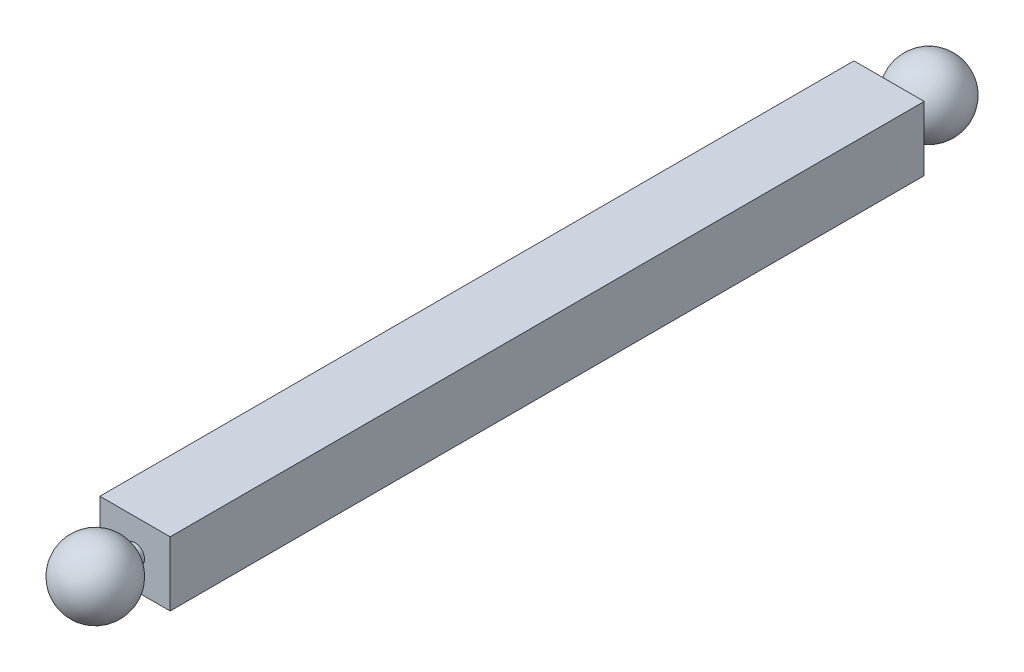
ISO-10303-21;
HEADER;
FILE_DESCRIPTION(('STEP AP214'),'2;1');
FILE_NAME('part.step','',(''),(''),'','','');
FILE_SCHEMA(('AUTOMOTIVE_DESIGN { 1 0 10303 214 1 1 1 1 }'));
ENDSEC;
DATA;
#1=APPLICATION_CONTEXT('core data for automotive mechanical design processes');
#2=APPLICATION_PROTOCOL_DEFINITION('international standard','automotive_design',2000,#1);
#3=PRODUCT_CONTEXT('',#1,'mechanical');
#4=PRODUCT('Part','Part','',(#3));
#5=PRODUCT_RELATED_PRODUCT_CATEGORY('part','',(#4));
#6=PRODUCT_DEFINITION_FORMATION('','',#4);
#7=PRODUCT_DEFINITION_CONTEXT('part definition',#1,'design');
#8=PRODUCT_DEFINITION('design','',#6,#7);
#9=PRODUCT_DEFINITION_SHAPE('','',#8);
#10=(LENGTH_UNIT() NAMED_UNIT(*) SI_UNIT(.MILLI.,.METRE.));
#11=(NAMED_UNIT(*) PLANE_ANGLE_UNIT() SI_UNIT($,.RADIAN.));
#12=(NAMED_UNIT(*) SI_UNIT($,.STERADIAN.) SOLID_ANGLE_UNIT());
#13=UNCERTAINTY_MEASURE_WITH_UNIT(LENGTH_MEASURE(1.E-05),#10,'distance_accuracy_value','');
#14=(GEOMETRIC_REPRESENTATION_CONTEXT(3) GLOBAL_UNCERTAINTY_ASSIGNED_CONTEXT((#13)) GLOBAL_UNIT_ASSIGNED_CONTEXT((#10,
#11,#12)) REPRESENTATION_CONTEXT('',''));
#15=CARTESIAN_POINT('',(0.,0.,0.));
#16=DIRECTION('',(0.,0.,1.));
#17=DIRECTION('',(1.,0.,0.));
#18=AXIS2_PLACEMENT_3D('',#15,#16,#17);
#19=CARTESIAN_POINT('',(-10.5102913715739,-5.52073960024874,5.));
#20=DIRECTION('',(0.737738097229949,0.675087031348947,0.));
#21=DIRECTION('',(0.675087031348947,-0.737738097229949,0.));
#22=AXIS2_PLACEMENT_3D('',#19,#20,#21);
#23=SPHERICAL_SURFACE('',#22,4.4);
#24=CARTESIAN_POINT('',(-10.5102913715739,-5.52073960024874,5.));
#25=DIRECTION('',(0.,0.,1.));
#26=DIRECTION('',(1.,0.,0.));
#27=AXIS2_PLACEMENT_3D('',#24,#25,#26);
#28=SPHERICAL_SURFACE('',#27,4.4);
#29=CARTESIAN_POINT('',(-10.5102913715739,-5.52073960024874,0.766797902296654));
#30=DIRECTION('',(0.,0.,1.));
#31=DIRECTION('',(1.,0.,0.));
#32=AXIS2_PLACEMENT_3D('',#29,#30,#31);
#33=CIRCLE('',#32,1.2);
#34=CARTESIAN_POINT('',(-9.31029137157393,-5.52073960024874,0.766797902296654));
#35=VERTEX_POINT('',#34);
#36=EDGE_CURVE('E11',#35,#35,#33,.F.);
#37=ORIENTED_EDGE('',*,*,#36,.F.);
#38=EDGE_LOOP('',(#37));
#39=FACE_BOUND('',#38,.T.);
#40=ADVANCED_FACE('F43',(#39),#28,.T.);
#41=CARTESIAN_POINT('',(-10.5102913715739,-5.52073960024874,5.));
#42=DIRECTION('',(0.,0.,-1.));
#43=DIRECTION('',(-1.,0.,0.));
#44=AXIS2_PLACEMENT_3D('',#41,#42,#43);
#45=CYLINDRICAL_SURFACE('',#44,1.2);
#46=ORIENTED_EDGE('',*,*,#36,.T.);
#47=EDGE_LOOP('',(#46));
#48=FACE_BOUND('',#47,.T.);
#49=CARTESIAN_POINT('',(-10.5102913715739,-5.52073960024874,0.));
#50=DIRECTION('',(0.,0.,1.));
#51=DIRECTION('',(1.,0.,0.));
#52=AXIS2_PLACEMENT_3D('',#49,#50,#51);
#53=CIRCLE('',#52,1.2);
#54=CARTESIAN_POINT('',(-9.31029137157393,-5.52073960024874,0.));
#55=VERTEX_POINT('',#54);
#56=EDGE_CURVE('E54',#55,#55,#53,.T.);
#57=ORIENTED_EDGE('',*,*,#56,.T.);
#58=EDGE_LOOP('',(#57));
#59=FACE_BOUND('',#58,.T.);
#60=ADVANCED_FACE('F45',(#48,#59),#45,.T.);
#61=CARTESIAN_POINT('',(-14.9361696103277,-1.47072101976475,-95.));
#62=DIRECTION('',(1.,0.,0.));
#63=DIRECTION('',(0.,0.,-1.));
#64=AXIS2_PLACEMENT_3D('',#61,#62,#63);
#65=PLANE('',#64);
#66=DIRECTION('',(0.,1.,0.));
#67=VECTOR('',#66,1.);
#68=CARTESIAN_POINT('',(-14.9361696103277,-1.47072101976475,0.));
#69=LINE('',#68,#67);
#70=CARTESIAN_POINT('',(-14.9361696103277,-9.57075818073273,0.));
#71=VERTEX_POINT('',#70);
#72=CARTESIAN_POINT('',(-14.9361696103277,-1.47072101976475,0.));
#73=VERTEX_POINT('',#72);
#74=EDGE_CURVE('E117',#71,#73,#69,.T.);
#75=ORIENTED_EDGE('',*,*,#74,.T.);
#76=DIRECTION('',(0.,0.,1.));
#77=VECTOR('',#76,1.);
#78=CARTESIAN_POINT('',(-14.9361696103277,-1.47072101976475,-95.));
#79=LINE('',#78,#77);
#80=CARTESIAN_POINT('',(-14.9361696103277,-1.47072101976475,-95.));
#81=VERTEX_POINT('',#80);
#82=EDGE_CURVE('E106',#81,#73,#79,.T.);
#83=ORIENTED_EDGE('',*,*,#82,.F.);
#84=DIRECTION('',(0.,1.,0.));
#85=VECTOR('',#84,1.);
#86=CARTESIAN_POINT('',(-14.9361696103277,-1.47072101976475,-95.));
#87=LINE('',#86,#85);
#88=CARTESIAN_POINT('',(-14.9361696103277,-9.57075818073273,-95.));
#89=VERTEX_POINT('',#88);
#90=EDGE_CURVE('E98',#89,#81,#87,.T.);
#91=ORIENTED_EDGE('',*,*,#90,.F.);
#92=DIRECTION('',(0.,0.,1.));
#93=VECTOR('',#92,1.);
#94=CARTESIAN_POINT('',(-14.9361696103277,-9.57075818073273,-95.));
#95=LINE('',#94,#93);
#96=EDGE_CURVE('E113',#89,#71,#95,.T.);
#97=ORIENTED_EDGE('',*,*,#96,.T.);
#98=EDGE_LOOP('',(#75,#83,#91,#97));
#99=FACE_BOUND('',#98,.T.);
#100=ADVANCED_FACE('F146',(#99),#65,.F.);
#101=CARTESIAN_POINT('',(-6.08441313282015,-1.47072101976475,-95.));
#102=DIRECTION('',(0.,-1.,0.));
#103=DIRECTION('',(0.,0.,-1.));
#104=AXIS2_PLACEMENT_3D('',#101,#102,#103);
#105=PLANE('',#104);
#106=DIRECTION('',(1.,0.,0.));
#107=VECTOR('',#106,1.);
#108=CARTESIAN_POINT('',(-6.08441313282015,-1.47072101976475,0.));
#109=LINE('',#108,#107);
#110=CARTESIAN_POINT('',(-6.08441313282015,-1.47072101976475,0.));
#111=VERTEX_POINT('',#110);
#112=EDGE_CURVE('E104',#73,#111,#109,.T.);
#113=ORIENTED_EDGE('',*,*,#112,.T.);
#114=DIRECTION('',(0.,0.,1.));
#115=VECTOR('',#114,1.);
#116=CARTESIAN_POINT('',(-6.08441313282015,-1.47072101976475,-95.));
#117=LINE('',#116,#115);
#118=CARTESIAN_POINT('',(-6.08441313282015,-1.47072101976475,-95.));
#119=VERTEX_POINT('',#118);
#120=EDGE_CURVE('E102',#119,#111,#117,.T.);
#121=ORIENTED_EDGE('',*,*,#120,.F.);
#122=DIRECTION('',(1.,0.,0.));
#123=VECTOR('',#122,1.);
#124=CARTESIAN_POINT('',(-6.08441313282015,-1.47072101976475,-95.));
#125=LINE('',#124,#123);
#126=EDGE_CURVE('E93',#81,#119,#125,.T.);
#127=ORIENTED_EDGE('',*,*,#126,.F.);
#128=ORIENTED_EDGE('',*,*,#82,.T.);
#129=EDGE_LOOP('',(#113,#121,#127,#128));
#130=FACE_BOUND('',#129,.T.);
#131=ADVANCED_FACE('F103',(#130),#105,.F.);
#132=CARTESIAN_POINT('',(-6.08441313282015,-1.47072101976475,-95.));
#133=DIRECTION('',(-1.,0.,0.));
#134=DIRECTION('',(0.,-1.,0.));
#135=AXIS2_PLACEMENT_3D('',#132,#133,#134);
#136=PLANE('',#135);
#137=DIRECTION('',(0.,-1.,0.));
#138=VECTOR('',#137,1.);
#139=CARTESIAN_POINT('',(-6.08441313282015,-1.47072101976475,0.));
#140=LINE('',#139,#138);
#141=CARTESIAN_POINT('',(-6.08441313282015,-9.57075818073273,0.));
#142=VERTEX_POINT('',#141);
#143=EDGE_CURVE('E79',#111,#142,#140,.T.);
#144=ORIENTED_EDGE('',*,*,#143,.T.);
#145=DIRECTION('',(0.,0.,1.));
#146=VECTOR('',#145,1.);
#147=CARTESIAN_POINT('',(-6.08441313282015,-9.57075818073273,-95.));
#148=LINE('',#147,#146);
#149=CARTESIAN_POINT('',(-6.08441313282015,-9.57075818073273,-95.));
#150=VERTEX_POINT('',#149);
#151=EDGE_CURVE('E107',#150,#142,#148,.T.);
#152=ORIENTED_EDGE('',*,*,#151,.F.);
#153=DIRECTION('',(0.,-1.,0.));
#154=VECTOR('',#153,1.);
#155=CARTESIAN_POINT('',(-6.08441313282015,-1.47072101976475,-95.));
#156=LINE('',#155,#154);
#157=EDGE_CURVE('E96',#119,#150,#156,.T.);
#158=ORIENTED_EDGE('',*,*,#157,.F.);
#159=ORIENTED_EDGE('',*,*,#120,.T.);
#160=EDGE_LOOP('',(#144,#152,#158,#159));
#161=FACE_BOUND('',#160,.T.);
#162=ADVANCED_FACE('F109',(#161),#136,.F.);
#163=CARTESIAN_POINT('',(-6.08441313282015,-9.57075818073273,-95.));
#164=DIRECTION('',(0.,1.,0.));
#165=DIRECTION('',(0.,0.,1.));
#166=AXIS2_PLACEMENT_3D('',#163,#164,#165);
#167=PLANE('',#166);
#168=DIRECTION('',(-1.,0.,0.));
#169=VECTOR('',#168,1.);
#170=CARTESIAN_POINT('',(-6.08441313282015,-9.57075818073273,0.));
#171=LINE('',#170,#169);
#172=EDGE_CURVE('E85',#142,#71,#171,.T.);
#173=ORIENTED_EDGE('',*,*,#172,.T.);
#174=ORIENTED_EDGE('',*,*,#96,.F.);
#175=DIRECTION('',(-1.,0.,0.));
#176=VECTOR('',#175,1.);
#177=CARTESIAN_POINT('',(-6.08441313282015,-9.57075818073273,-95.));
#178=LINE('',#177,#176);
#179=EDGE_CURVE('E62',#150,#89,#178,.T.);
#180=ORIENTED_EDGE('',*,*,#179,.F.);
#181=ORIENTED_EDGE('',*,*,#151,.T.);
#182=EDGE_LOOP('',(#173,#174,#180,#181));
#183=FACE_BOUND('',#182,.T.);
#184=ADVANCED_FACE('F147',(#183),#167,.F.);
#185=CARTESIAN_POINT('',(0.,0.,-95.));
#186=DIRECTION('',(0.,0.,-1.));
#187=DIRECTION('',(-1.,0.,0.));
#188=AXIS2_PLACEMENT_3D('',#185,#186,#187);
#189=PLANE('',#188);
#190=CARTESIAN_POINT('',(-10.5102913715739,-5.52073960024874,-95.));
#191=DIRECTION('',(0.,0.,-1.));
#192=DIRECTION('',(-1.,0.,0.));
#193=AXIS2_PLACEMENT_3D('',#190,#191,#192);
#194=CIRCLE('',#193,0.800000000000001);
#195=CARTESIAN_POINT('',(-11.3102913715739,-5.52073960024874,-95.));
#196=VERTEX_POINT('',#195);
#197=EDGE_CURVE('E121',#196,#196,#194,.T.);
#198=ORIENTED_EDGE('',*,*,#197,.F.);
#199=EDGE_LOOP('',(#198));
#200=FACE_BOUND('',#199,.T.);
#201=ORIENTED_EDGE('',*,*,#90,.T.);
#202=ORIENTED_EDGE('',*,*,#126,.T.);
#203=ORIENTED_EDGE('',*,*,#157,.T.);
#204=ORIENTED_EDGE('',*,*,#179,.T.);
#205=EDGE_LOOP('',(#201,#202,#203,#204));
#206=FACE_BOUND('',#205,.T.);
#207=ADVANCED_FACE('F94',(#200,#206),#189,.T.);
#208=CARTESIAN_POINT('',(0.,0.,0.));
#209=DIRECTION('',(0.,0.,-1.));
#210=DIRECTION('',(-1.,0.,0.));
#211=AXIS2_PLACEMENT_3D('',#208,#209,#210);
#212=PLANE('',#211);
#213=ORIENTED_EDGE('',*,*,#56,.F.);
#214=EDGE_LOOP('',(#213));
#215=FACE_BOUND('',#214,.T.);
#216=ORIENTED_EDGE('',*,*,#74,.F.);
#217=ORIENTED_EDGE('',*,*,#172,.F.);
#218=ORIENTED_EDGE('',*,*,#143,.F.);
#219=ORIENTED_EDGE('',*,*,#112,.F.);
#220=EDGE_LOOP('',(#216,#217,#218,#219));
#221=FACE_BOUND('',#220,.T.);
#222=ADVANCED_FACE('F139',(#215,#221),#212,.F.);
#223=CARTESIAN_POINT('',(-10.5102913715739,-5.52073960024874,-100.));
#224=DIRECTION('',(0.,0.,1.));
#225=DIRECTION('',(1.,0.,0.));
#226=AXIS2_PLACEMENT_3D('',#223,#224,#225);
#227=CYLINDRICAL_SURFACE('',#226,0.800000000000001);
#228=CARTESIAN_POINT('',(-10.5102913715739,-5.52073960024874,-95.6733384694432));
#229=DIRECTION('',(0.,0.,-1.));
#230=DIRECTION('',(-1.,0.,0.));
#231=AXIS2_PLACEMENT_3D('',#228,#229,#230);
#232=CIRCLE('',#231,0.800000000000001);
#233=CARTESIAN_POINT('',(-11.3102913715739,-5.52073960024874,-95.6733384694432));
#234=VERTEX_POINT('',#233);
#235=EDGE_CURVE('E47',#234,#234,#232,.F.);
#236=ORIENTED_EDGE('',*,*,#235,.T.);
#237=EDGE_LOOP('',(#236));
#238=FACE_BOUND('',#237,.T.);
#239=ORIENTED_EDGE('',*,*,#197,.T.);
#240=EDGE_LOOP('',(#239));
#241=FACE_BOUND('',#240,.T.);
#242=ADVANCED_FACE('F142',(#238,#241),#227,.T.);
#243=CARTESIAN_POINT('',(-10.5102913715739,-5.52073960024874,-100.));
#244=DIRECTION('',(-0.737738097229949,0.675087031348947,0.));
#245=DIRECTION('',(0.675087031348947,0.737738097229949,0.));
#246=AXIS2_PLACEMENT_3D('',#243,#244,#245);
#247=SPHERICAL_SURFACE('',#246,4.4);
#248=CARTESIAN_POINT('',(-10.5102913715739,-5.52073960024874,-100.));
#249=DIRECTION('',(0.,0.,-1.));
#250=DIRECTION('',(-1.,0.,0.));
#251=AXIS2_PLACEMENT_3D('',#248,#249,#250);
#252=SPHERICAL_SURFACE('',#251,4.4);
#253=ORIENTED_EDGE('',*,*,#235,.F.);
#254=EDGE_LOOP('',(#253));
#255=FACE_BOUND('',#254,.T.);
#256=ADVANCED_FACE('F201',(#255),#252,.T.);
#257=CLOSED_SHELL('',(#40,#60,#100,#131,#162,#184,#207,#222,#242,#256));
#258=MANIFOLD_SOLID_BREP('B2',#257);
#259=ADVANCED_BREP_SHAPE_REPRESENTATION('',(#18,#258),#14);
#260=SHAPE_DEFINITION_REPRESENTATION(#9,#259);
ENDSEC;
END-ISO-10303-21;
